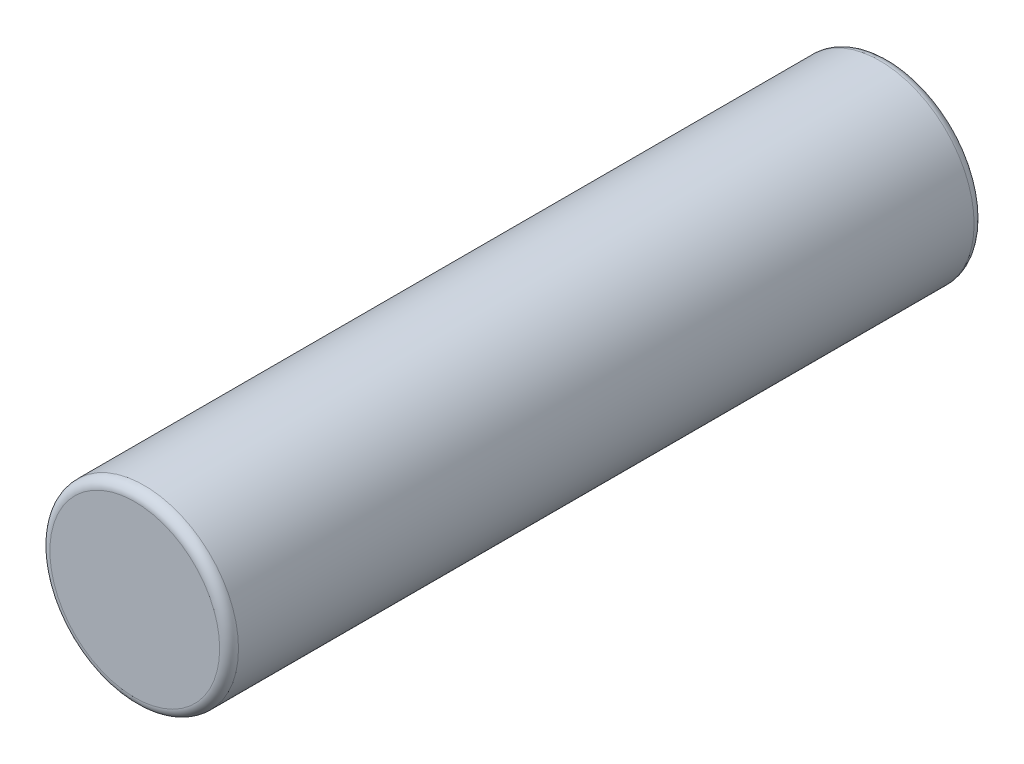
ISO-10303-21;
HEADER;
FILE_DESCRIPTION(('STEP AP214'),'2;1');
FILE_NAME('part.step','',(''),(''),'','','');
FILE_SCHEMA(('AUTOMOTIVE_DESIGN { 1 0 10303 214 1 1 1 1 }'));
ENDSEC;
DATA;
#1=APPLICATION_CONTEXT('core data for automotive mechanical design processes');
#2=APPLICATION_PROTOCOL_DEFINITION('international standard','automotive_design',2000,#1);
#3=PRODUCT_CONTEXT('',#1,'mechanical');
#4=PRODUCT('Part','Part','',(#3));
#5=PRODUCT_RELATED_PRODUCT_CATEGORY('part','',(#4));
#6=PRODUCT_DEFINITION_FORMATION('','',#4);
#7=PRODUCT_DEFINITION_CONTEXT('part definition',#1,'design');
#8=PRODUCT_DEFINITION('design','',#6,#7);
#9=PRODUCT_DEFINITION_SHAPE('','',#8);
#10=(LENGTH_UNIT() NAMED_UNIT(*) SI_UNIT(.MILLI.,.METRE.));
#11=(NAMED_UNIT(*) PLANE_ANGLE_UNIT() SI_UNIT($,.RADIAN.));
#12=(NAMED_UNIT(*) SI_UNIT($,.STERADIAN.) SOLID_ANGLE_UNIT());
#13=UNCERTAINTY_MEASURE_WITH_UNIT(LENGTH_MEASURE(1.E-05),#10,'distance_accuracy_value','');
#14=(GEOMETRIC_REPRESENTATION_CONTEXT(3) GLOBAL_UNCERTAINTY_ASSIGNED_CONTEXT((#13)) GLOBAL_UNIT_ASSIGNED_CONTEXT((#10,
#11,#12)) REPRESENTATION_CONTEXT('',''));
#15=CARTESIAN_POINT('',(0.,0.,0.));
#16=DIRECTION('',(0.,0.,1.));
#17=DIRECTION('',(1.,0.,0.));
#18=AXIS2_PLACEMENT_3D('',#15,#16,#17);
#19=CARTESIAN_POINT('',(0.,0.,160.));
#20=DIRECTION('',(0.,0.,-1.));
#21=DIRECTION('',(-1.,0.,0.));
#22=AXIS2_PLACEMENT_3D('',#19,#20,#21);
#23=CYLINDRICAL_SURFACE('',#22,20.);
#24=CARTESIAN_POINT('',(0.,0.,2.));
#25=DIRECTION('',(0.,0.,1.));
#26=DIRECTION('',(1.,0.,0.));
#27=AXIS2_PLACEMENT_3D('',#24,#25,#26);
#28=CIRCLE('',#27,20.);
#29=CARTESIAN_POINT('',(20.,0.,2.));
#30=VERTEX_POINT('',#29);
#31=EDGE_CURVE('E45',#30,#30,#28,.T.);
#32=ORIENTED_EDGE('',*,*,#31,.T.);
#33=EDGE_LOOP('',(#32));
#34=FACE_BOUND('',#33,.T.);
#35=CARTESIAN_POINT('',(0.,0.,158.));
#36=DIRECTION('',(0.,0.,1.));
#37=DIRECTION('',(1.,0.,0.));
#38=AXIS2_PLACEMENT_3D('',#35,#36,#37);
#39=CIRCLE('',#38,20.);
#40=CARTESIAN_POINT('',(20.,0.,158.));
#41=VERTEX_POINT('',#40);
#42=EDGE_CURVE('E49',#41,#41,#39,.F.);
#43=ORIENTED_EDGE('',*,*,#42,.T.);
#44=EDGE_LOOP('',(#43));
#45=FACE_BOUND('',#44,.T.);
#46=ADVANCED_FACE('F34',(#34,#45),#23,.T.);
#47=CARTESIAN_POINT('',(0.,0.,160.));
#48=DIRECTION('',(0.,0.,1.));
#49=DIRECTION('',(1.,0.,0.));
#50=AXIS2_PLACEMENT_3D('',#47,#48,#49);
#51=PLANE('',#50);
#52=CARTESIAN_POINT('',(0.,0.,160.));
#53=DIRECTION('',(0.,0.,1.));
#54=DIRECTION('',(1.,0.,0.));
#55=AXIS2_PLACEMENT_3D('',#52,#53,#54);
#56=CIRCLE('',#55,18.);
#57=CARTESIAN_POINT('',(18.,0.,160.));
#58=VERTEX_POINT('',#57);
#59=EDGE_CURVE('E10',#58,#58,#56,.T.);
#60=ORIENTED_EDGE('',*,*,#59,.T.);
#61=EDGE_LOOP('',(#60));
#62=FACE_BOUND('',#61,.T.);
#63=ADVANCED_FACE('F65',(#62),#51,.T.);
#64=CARTESIAN_POINT('',(0.,0.,0.));
#65=DIRECTION('',(0.,0.,1.));
#66=DIRECTION('',(1.,0.,0.));
#67=AXIS2_PLACEMENT_3D('',#64,#65,#66);
#68=PLANE('',#67);
#69=CARTESIAN_POINT('',(0.,0.,0.));
#70=DIRECTION('',(0.,0.,1.));
#71=DIRECTION('',(1.,0.,0.));
#72=AXIS2_PLACEMENT_3D('',#69,#70,#71);
#73=CIRCLE('',#72,18.);
#74=CARTESIAN_POINT('',(18.,0.,0.));
#75=VERTEX_POINT('',#74);
#76=EDGE_CURVE('E41',#75,#75,#73,.F.);
#77=ORIENTED_EDGE('',*,*,#76,.T.);
#78=EDGE_LOOP('',(#77));
#79=FACE_BOUND('',#78,.T.);
#80=ADVANCED_FACE('F62',(#79),#68,.F.);
#81=CARTESIAN_POINT('',(0.,0.,2.));
#82=DIRECTION('',(0.,0.,1.));
#83=DIRECTION('',(1.,0.,0.));
#84=AXIS2_PLACEMENT_3D('',#81,#82,#83);
#85=TOROIDAL_SURFACE('',#84,18.,2.);
#86=ORIENTED_EDGE('',*,*,#76,.F.);
#87=EDGE_LOOP('',(#86));
#88=FACE_BOUND('',#87,.T.);
#89=ORIENTED_EDGE('',*,*,#31,.F.);
#90=EDGE_LOOP('',(#89));
#91=FACE_BOUND('',#90,.T.);
#92=ADVANCED_FACE('F58',(#88,#91),#85,.T.);
#93=CARTESIAN_POINT('',(0.,0.,158.));
#94=DIRECTION('',(0.,0.,1.));
#95=DIRECTION('',(1.,0.,0.));
#96=AXIS2_PLACEMENT_3D('',#93,#94,#95);
#97=TOROIDAL_SURFACE('',#96,18.,2.);
#98=ORIENTED_EDGE('',*,*,#42,.F.);
#99=EDGE_LOOP('',(#98));
#100=FACE_BOUND('',#99,.T.);
#101=ORIENTED_EDGE('',*,*,#59,.F.);
#102=EDGE_LOOP('',(#101));
#103=FACE_BOUND('',#102,.T.);
#104=ADVANCED_FACE('F36',(#100,#103),#97,.T.);
#105=CLOSED_SHELL('',(#46,#63,#80,#92,#104));
#106=MANIFOLD_SOLID_BREP('B2',#105);
#107=ADVANCED_BREP_SHAPE_REPRESENTATION('',(#18,#106),#14);
#108=SHAPE_DEFINITION_REPRESENTATION(#9,#107);
ENDSEC;
END-ISO-10303-21;
